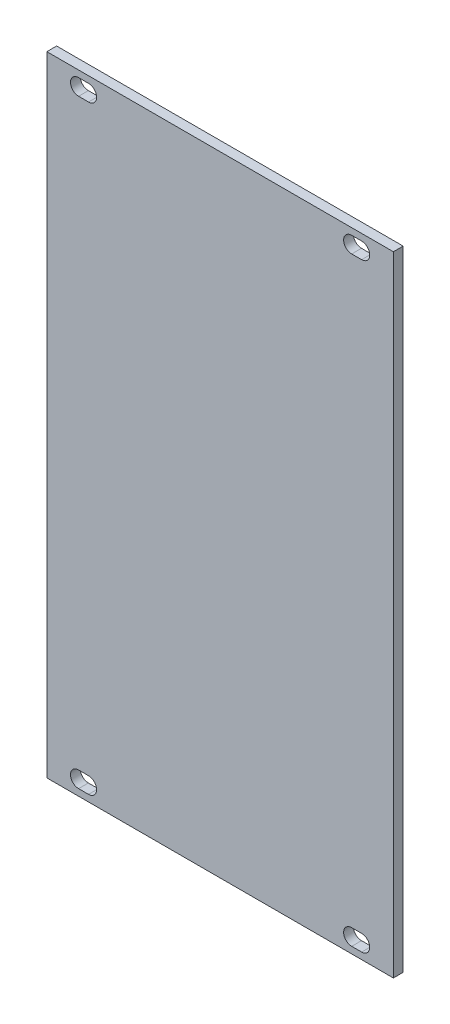
ISO-10303-21;
HEADER;
FILE_DESCRIPTION(('STEP AP214'),'2;1');
FILE_NAME('part.step','',(''),(''),'','','');
FILE_SCHEMA(('AUTOMOTIVE_DESIGN { 1 0 10303 214 1 1 1 1 }'));
ENDSEC;
DATA;
#1=APPLICATION_CONTEXT('core data for automotive mechanical design processes');
#2=APPLICATION_PROTOCOL_DEFINITION('international standard','automotive_design',2000,#1);
#3=PRODUCT_CONTEXT('',#1,'mechanical');
#4=PRODUCT('Part','Part','',(#3));
#5=PRODUCT_RELATED_PRODUCT_CATEGORY('part','',(#4));
#6=PRODUCT_DEFINITION_FORMATION('','',#4);
#7=PRODUCT_DEFINITION_CONTEXT('part definition',#1,'design');
#8=PRODUCT_DEFINITION('design','',#6,#7);
#9=PRODUCT_DEFINITION_SHAPE('','',#8);
#10=(LENGTH_UNIT() NAMED_UNIT(*) SI_UNIT(.MILLI.,.METRE.));
#11=(NAMED_UNIT(*) PLANE_ANGLE_UNIT() SI_UNIT($,.RADIAN.));
#12=(NAMED_UNIT(*) SI_UNIT($,.STERADIAN.) SOLID_ANGLE_UNIT());
#13=UNCERTAINTY_MEASURE_WITH_UNIT(LENGTH_MEASURE(1.E-05),#10,'distance_accuracy_value','');
#14=(GEOMETRIC_REPRESENTATION_CONTEXT(3) GLOBAL_UNCERTAINTY_ASSIGNED_CONTEXT((#13)) GLOBAL_UNIT_ASSIGNED_CONTEXT((#10,
#11,#12)) REPRESENTATION_CONTEXT('',''));
#15=CARTESIAN_POINT('',(0.,0.,0.));
#16=DIRECTION('',(0.,0.,1.));
#17=DIRECTION('',(1.,0.,0.));
#18=AXIS2_PLACEMENT_3D('',#15,#16,#17);
#19=CARTESIAN_POINT('',(0.,0.,2.));
#20=DIRECTION('',(0.,0.,1.));
#21=DIRECTION('',(1.,0.,0.));
#22=AXIS2_PLACEMENT_3D('',#19,#20,#21);
#23=PLANE('',#22);
#24=DIRECTION('',(0.,1.,0.));
#25=VECTOR('',#24,1.);
#26=CARTESIAN_POINT('',(35.4,64.25,2.));
#27=LINE('',#26,#25);
#28=CARTESIAN_POINT('',(35.4,-64.25,2.));
#29=VERTEX_POINT('',#28);
#30=CARTESIAN_POINT('',(35.4,64.25,2.));
#31=VERTEX_POINT('',#30);
#32=EDGE_CURVE('E360',#29,#31,#27,.T.);
#33=ORIENTED_EDGE('',*,*,#32,.T.);
#34=DIRECTION('',(-1.,0.,0.));
#35=VECTOR('',#34,1.);
#36=CARTESIAN_POINT('',(-35.4,64.25,2.));
#37=LINE('',#36,#35);
#38=CARTESIAN_POINT('',(-35.4,64.25,2.));
#39=VERTEX_POINT('',#38);
#40=EDGE_CURVE('E364',#31,#39,#37,.T.);
#41=ORIENTED_EDGE('',*,*,#40,.T.);
#42=DIRECTION('',(0.,-1.,0.));
#43=VECTOR('',#42,1.);
#44=CARTESIAN_POINT('',(-35.4,64.25,2.));
#45=LINE('',#44,#43);
#46=CARTESIAN_POINT('',(-35.4,-64.25,2.));
#47=VERTEX_POINT('',#46);
#48=EDGE_CURVE('E368',#39,#47,#45,.T.);
#49=ORIENTED_EDGE('',*,*,#48,.T.);
#50=DIRECTION('',(1.,0.,0.));
#51=VECTOR('',#50,1.);
#52=CARTESIAN_POINT('',(-35.4,-64.25,2.));
#53=LINE('',#52,#51);
#54=EDGE_CURVE('E371',#47,#29,#53,.T.);
#55=ORIENTED_EDGE('',*,*,#54,.T.);
#56=EDGE_LOOP('',(#33,#41,#49,#55));
#57=FACE_BOUND('',#56,.T.);
#58=DIRECTION('',(1.,0.,0.));
#59=VECTOR('',#58,1.);
#60=CARTESIAN_POINT('',(-28.916,-62.9,2.));
#61=LINE('',#60,#59);
#62=CARTESIAN_POINT('',(-28.916,-62.9,2.));
#63=VERTEX_POINT('',#62);
#64=CARTESIAN_POINT('',(-26.884,-62.9,2.));
#65=VERTEX_POINT('',#64);
#66=EDGE_CURVE('E320',#63,#65,#61,.T.);
#67=ORIENTED_EDGE('',*,*,#66,.F.);
#68=CARTESIAN_POINT('',(-28.916,-61.25,2.));
#69=DIRECTION('',(0.,0.,1.));
#70=DIRECTION('',(1.,0.,0.));
#71=AXIS2_PLACEMENT_3D('',#68,#69,#70);
#72=CIRCLE('',#71,1.65);
#73=CARTESIAN_POINT('',(-28.916,-59.6,2.));
#74=VERTEX_POINT('',#73);
#75=EDGE_CURVE('E317',#74,#63,#72,.T.);
#76=ORIENTED_EDGE('',*,*,#75,.F.);
#77=DIRECTION('',(-1.,0.,0.));
#78=VECTOR('',#77,1.);
#79=CARTESIAN_POINT('',(-28.916,-59.6,2.));
#80=LINE('',#79,#78);
#81=CARTESIAN_POINT('',(-26.884,-59.6,2.));
#82=VERTEX_POINT('',#81);
#83=EDGE_CURVE('E328',#82,#74,#80,.T.);
#84=ORIENTED_EDGE('',*,*,#83,.F.);
#85=CARTESIAN_POINT('',(-26.884,-61.25,2.));
#86=DIRECTION('',(0.,0.,1.));
#87=DIRECTION('',(1.,0.,0.));
#88=AXIS2_PLACEMENT_3D('',#85,#86,#87);
#89=CIRCLE('',#88,1.64999999999999);
#90=EDGE_CURVE('E324',#65,#82,#89,.T.);
#91=ORIENTED_EDGE('',*,*,#90,.F.);
#92=EDGE_LOOP('',(#67,#76,#84,#91));
#93=FACE_BOUND('',#92,.T.);
#94=DIRECTION('',(1.,0.,0.));
#95=VECTOR('',#94,1.);
#96=CARTESIAN_POINT('',(26.884000014,59.6,2.));
#97=LINE('',#96,#95);
#98=CARTESIAN_POINT('',(26.884000014,59.6,2.));
#99=VERTEX_POINT('',#98);
#100=CARTESIAN_POINT('',(28.916000014,59.6,2.));
#101=VERTEX_POINT('',#100);
#102=EDGE_CURVE('E277',#99,#101,#97,.T.);
#103=ORIENTED_EDGE('',*,*,#102,.F.);
#104=CARTESIAN_POINT('',(26.884000014,61.25,2.));
#105=DIRECTION('',(0.,0.,1.));
#106=DIRECTION('',(1.,0.,0.));
#107=AXIS2_PLACEMENT_3D('',#104,#105,#106);
#108=CIRCLE('',#107,1.65);
#109=CARTESIAN_POINT('',(26.884000014,62.9,2.));
#110=VERTEX_POINT('',#109);
#111=EDGE_CURVE('E274',#110,#99,#108,.T.);
#112=ORIENTED_EDGE('',*,*,#111,.F.);
#113=DIRECTION('',(-1.,0.,0.));
#114=VECTOR('',#113,1.);
#115=CARTESIAN_POINT('',(26.884000014,62.9,2.));
#116=LINE('',#115,#114);
#117=CARTESIAN_POINT('',(28.916000014,62.9,2.));
#118=VERTEX_POINT('',#117);
#119=EDGE_CURVE('E285',#118,#110,#116,.T.);
#120=ORIENTED_EDGE('',*,*,#119,.F.);
#121=CARTESIAN_POINT('',(28.916000014,61.25,2.));
#122=DIRECTION('',(0.,0.,1.));
#123=DIRECTION('',(1.,0.,0.));
#124=AXIS2_PLACEMENT_3D('',#121,#122,#123);
#125=CIRCLE('',#124,1.65);
#126=EDGE_CURVE('E281',#101,#118,#125,.T.);
#127=ORIENTED_EDGE('',*,*,#126,.F.);
#128=EDGE_LOOP('',(#103,#112,#120,#127));
#129=FACE_BOUND('',#128,.T.);
#130=DIRECTION('',(1.,0.,0.));
#131=VECTOR('',#130,1.);
#132=CARTESIAN_POINT('',(-28.916,59.6,2.));
#133=LINE('',#132,#131);
#134=CARTESIAN_POINT('',(-28.916,59.6,2.));
#135=VERTEX_POINT('',#134);
#136=CARTESIAN_POINT('',(-26.884,59.6,2.));
#137=VERTEX_POINT('',#136);
#138=EDGE_CURVE('E234',#135,#137,#133,.T.);
#139=ORIENTED_EDGE('',*,*,#138,.F.);
#140=CARTESIAN_POINT('',(-28.916,61.25,2.));
#141=DIRECTION('',(0.,0.,1.));
#142=DIRECTION('',(1.,0.,0.));
#143=AXIS2_PLACEMENT_3D('',#140,#141,#142);
#144=CIRCLE('',#143,1.64999999999998);
#145=CARTESIAN_POINT('',(-28.916,62.9,2.));
#146=VERTEX_POINT('',#145);
#147=EDGE_CURVE('E231',#146,#135,#144,.T.);
#148=ORIENTED_EDGE('',*,*,#147,.F.);
#149=DIRECTION('',(-1.,0.,0.));
#150=VECTOR('',#149,1.);
#151=CARTESIAN_POINT('',(-28.916,62.9,2.));
#152=LINE('',#151,#150);
#153=CARTESIAN_POINT('',(-26.884,62.9,2.));
#154=VERTEX_POINT('',#153);
#155=EDGE_CURVE('E242',#154,#146,#152,.T.);
#156=ORIENTED_EDGE('',*,*,#155,.F.);
#157=CARTESIAN_POINT('',(-26.884,61.25,2.));
#158=DIRECTION('',(0.,0.,1.));
#159=DIRECTION('',(1.,0.,0.));
#160=AXIS2_PLACEMENT_3D('',#157,#158,#159);
#161=CIRCLE('',#160,1.64999999999998);
#162=EDGE_CURVE('E238',#137,#154,#161,.T.);
#163=ORIENTED_EDGE('',*,*,#162,.F.);
#164=EDGE_LOOP('',(#139,#148,#156,#163));
#165=FACE_BOUND('',#164,.T.);
#166=DIRECTION('',(1.,0.,0.));
#167=VECTOR('',#166,1.);
#168=CARTESIAN_POINT('',(26.884000014,-62.9,2.));
#169=LINE('',#168,#167);
#170=CARTESIAN_POINT('',(26.884000014,-62.9,2.));
#171=VERTEX_POINT('',#170);
#172=CARTESIAN_POINT('',(28.916000014,-62.9,2.));
#173=VERTEX_POINT('',#172);
#174=EDGE_CURVE('E192',#171,#173,#169,.T.);
#175=ORIENTED_EDGE('',*,*,#174,.F.);
#176=CARTESIAN_POINT('',(26.884000014,-61.25,2.));
#177=DIRECTION('',(0.,0.,1.));
#178=DIRECTION('',(1.,0.,0.));
#179=AXIS2_PLACEMENT_3D('',#176,#177,#178);
#180=CIRCLE('',#179,1.65);
#181=CARTESIAN_POINT('',(26.884000014,-59.6,2.));
#182=VERTEX_POINT('',#181);
#183=EDGE_CURVE('E183',#182,#171,#180,.T.);
#184=ORIENTED_EDGE('',*,*,#183,.F.);
#185=DIRECTION('',(-1.,0.,0.));
#186=VECTOR('',#185,1.);
#187=CARTESIAN_POINT('',(26.884000014,-59.6,2.));
#188=LINE('',#187,#186);
#189=CARTESIAN_POINT('',(28.916000014,-59.6,2.));
#190=VERTEX_POINT('',#189);
#191=EDGE_CURVE('E209',#190,#182,#188,.T.);
#192=ORIENTED_EDGE('',*,*,#191,.F.);
#193=CARTESIAN_POINT('',(28.916000014,-61.25,2.));
#194=DIRECTION('',(0.,0.,1.));
#195=DIRECTION('',(1.,0.,0.));
#196=AXIS2_PLACEMENT_3D('',#193,#194,#195);
#197=CIRCLE('',#196,1.65);
#198=EDGE_CURVE('E205',#173,#190,#197,.T.);
#199=ORIENTED_EDGE('',*,*,#198,.F.);
#200=EDGE_LOOP('',(#175,#184,#192,#199));
#201=FACE_BOUND('',#200,.T.);
#202=ADVANCED_FACE('F45',(#57,#93,#129,#165,#201),#23,.T.);
#203=CARTESIAN_POINT('',(0.,0.,0.));
#204=DIRECTION('',(0.,0.,1.));
#205=DIRECTION('',(1.,0.,0.));
#206=AXIS2_PLACEMENT_3D('',#203,#204,#205);
#207=PLANE('',#206);
#208=CARTESIAN_POINT('',(-28.916,61.25,0.));
#209=DIRECTION('',(0.,0.,1.));
#210=DIRECTION('',(1.,0.,0.));
#211=AXIS2_PLACEMENT_3D('',#208,#209,#210);
#212=CIRCLE('',#211,1.64999999999998);
#213=CARTESIAN_POINT('',(-28.916,62.9,0.));
#214=VERTEX_POINT('',#213);
#215=CARTESIAN_POINT('',(-28.916,59.6,0.));
#216=VERTEX_POINT('',#215);
#217=EDGE_CURVE('E201',#214,#216,#212,.T.);
#218=ORIENTED_EDGE('',*,*,#217,.T.);
#219=DIRECTION('',(1.,0.,0.));
#220=VECTOR('',#219,1.);
#221=CARTESIAN_POINT('',(-28.916,59.6,0.));
#222=LINE('',#221,#220);
#223=CARTESIAN_POINT('',(-26.884,59.6,0.));
#224=VERTEX_POINT('',#223);
#225=EDGE_CURVE('E249',#216,#224,#222,.T.);
#226=ORIENTED_EDGE('',*,*,#225,.T.);
#227=CARTESIAN_POINT('',(-26.884,61.25,0.));
#228=DIRECTION('',(0.,0.,1.));
#229=DIRECTION('',(1.,0.,0.));
#230=AXIS2_PLACEMENT_3D('',#227,#228,#229);
#231=CIRCLE('',#230,1.64999999999998);
#232=CARTESIAN_POINT('',(-26.884,62.9,0.));
#233=VERTEX_POINT('',#232);
#234=EDGE_CURVE('E253',#224,#233,#231,.T.);
#235=ORIENTED_EDGE('',*,*,#234,.T.);
#236=DIRECTION('',(-1.,0.,0.));
#237=VECTOR('',#236,1.);
#238=CARTESIAN_POINT('',(-28.916,62.9,0.));
#239=LINE('',#238,#237);
#240=EDGE_CURVE('E235',#233,#214,#239,.T.);
#241=ORIENTED_EDGE('',*,*,#240,.T.);
#242=EDGE_LOOP('',(#218,#226,#235,#241));
#243=FACE_BOUND('',#242,.T.);
#244=CARTESIAN_POINT('',(-28.916,-61.25,0.));
#245=DIRECTION('',(0.,0.,1.));
#246=DIRECTION('',(1.,0.,0.));
#247=AXIS2_PLACEMENT_3D('',#244,#245,#246);
#248=CIRCLE('',#247,1.65);
#249=CARTESIAN_POINT('',(-28.916,-59.6,0.));
#250=VERTEX_POINT('',#249);
#251=CARTESIAN_POINT('',(-28.916,-62.9,0.));
#252=VERTEX_POINT('',#251);
#253=EDGE_CURVE('E316',#250,#252,#248,.T.);
#254=ORIENTED_EDGE('',*,*,#253,.T.);
#255=DIRECTION('',(1.,0.,0.));
#256=VECTOR('',#255,1.);
#257=CARTESIAN_POINT('',(-28.916,-62.9,0.));
#258=LINE('',#257,#256);
#259=CARTESIAN_POINT('',(-26.884,-62.9,0.));
#260=VERTEX_POINT('',#259);
#261=EDGE_CURVE('E335',#252,#260,#258,.T.);
#262=ORIENTED_EDGE('',*,*,#261,.T.);
#263=CARTESIAN_POINT('',(-26.884,-61.25,0.));
#264=DIRECTION('',(0.,0.,1.));
#265=DIRECTION('',(1.,0.,0.));
#266=AXIS2_PLACEMENT_3D('',#263,#264,#265);
#267=CIRCLE('',#266,1.64999999999999);
#268=CARTESIAN_POINT('',(-26.884,-59.6,0.));
#269=VERTEX_POINT('',#268);
#270=EDGE_CURVE('E339',#260,#269,#267,.T.);
#271=ORIENTED_EDGE('',*,*,#270,.T.);
#272=DIRECTION('',(-1.,0.,0.));
#273=VECTOR('',#272,1.);
#274=CARTESIAN_POINT('',(-28.916,-59.6,0.));
#275=LINE('',#274,#273);
#276=EDGE_CURVE('E321',#269,#250,#275,.T.);
#277=ORIENTED_EDGE('',*,*,#276,.T.);
#278=EDGE_LOOP('',(#254,#262,#271,#277));
#279=FACE_BOUND('',#278,.T.);
#280=DIRECTION('',(0.,1.,0.));
#281=VECTOR('',#280,1.);
#282=CARTESIAN_POINT('',(35.4,64.25,0.));
#283=LINE('',#282,#281);
#284=CARTESIAN_POINT('',(35.4,-64.25,0.));
#285=VERTEX_POINT('',#284);
#286=CARTESIAN_POINT('',(35.4,64.25,0.));
#287=VERTEX_POINT('',#286);
#288=EDGE_CURVE('E359',#285,#287,#283,.T.);
#289=ORIENTED_EDGE('',*,*,#288,.F.);
#290=DIRECTION('',(1.,0.,0.));
#291=VECTOR('',#290,1.);
#292=CARTESIAN_POINT('',(-35.4,-64.25,0.));
#293=LINE('',#292,#291);
#294=CARTESIAN_POINT('',(-35.4,-64.25,0.));
#295=VERTEX_POINT('',#294);
#296=EDGE_CURVE('E365',#295,#285,#293,.T.);
#297=ORIENTED_EDGE('',*,*,#296,.F.);
#298=DIRECTION('',(0.,-1.,0.));
#299=VECTOR('',#298,1.);
#300=CARTESIAN_POINT('',(-35.4,64.25,0.));
#301=LINE('',#300,#299);
#302=CARTESIAN_POINT('',(-35.4,64.25,0.));
#303=VERTEX_POINT('',#302);
#304=EDGE_CURVE('E381',#303,#295,#301,.T.);
#305=ORIENTED_EDGE('',*,*,#304,.F.);
#306=DIRECTION('',(-1.,0.,0.));
#307=VECTOR('',#306,1.);
#308=CARTESIAN_POINT('',(-35.4,64.25,0.));
#309=LINE('',#308,#307);
#310=EDGE_CURVE('E378',#287,#303,#309,.T.);
#311=ORIENTED_EDGE('',*,*,#310,.F.);
#312=EDGE_LOOP('',(#289,#297,#305,#311));
#313=FACE_BOUND('',#312,.T.);
#314=CARTESIAN_POINT('',(26.884000014,61.25,0.));
#315=DIRECTION('',(0.,0.,1.));
#316=DIRECTION('',(1.,0.,0.));
#317=AXIS2_PLACEMENT_3D('',#314,#315,#316);
#318=CIRCLE('',#317,1.65);
#319=CARTESIAN_POINT('',(26.884000014,62.9,0.));
#320=VERTEX_POINT('',#319);
#321=CARTESIAN_POINT('',(26.884000014,59.6,0.));
#322=VERTEX_POINT('',#321);
#323=EDGE_CURVE('E273',#320,#322,#318,.T.);
#324=ORIENTED_EDGE('',*,*,#323,.T.);
#325=DIRECTION('',(1.,0.,0.));
#326=VECTOR('',#325,1.);
#327=CARTESIAN_POINT('',(26.884000014,59.6,0.));
#328=LINE('',#327,#326);
#329=CARTESIAN_POINT('',(28.916000014,59.6,0.));
#330=VERTEX_POINT('',#329);
#331=EDGE_CURVE('E292',#322,#330,#328,.T.);
#332=ORIENTED_EDGE('',*,*,#331,.T.);
#333=CARTESIAN_POINT('',(28.916000014,61.25,0.));
#334=DIRECTION('',(0.,0.,1.));
#335=DIRECTION('',(1.,0.,0.));
#336=AXIS2_PLACEMENT_3D('',#333,#334,#335);
#337=CIRCLE('',#336,1.65);
#338=CARTESIAN_POINT('',(28.916000014,62.9,0.));
#339=VERTEX_POINT('',#338);
#340=EDGE_CURVE('E296',#330,#339,#337,.T.);
#341=ORIENTED_EDGE('',*,*,#340,.T.);
#342=DIRECTION('',(-1.,0.,0.));
#343=VECTOR('',#342,1.);
#344=CARTESIAN_POINT('',(26.884000014,62.9,0.));
#345=LINE('',#344,#343);
#346=EDGE_CURVE('E278',#339,#320,#345,.T.);
#347=ORIENTED_EDGE('',*,*,#346,.T.);
#348=EDGE_LOOP('',(#324,#332,#341,#347));
#349=FACE_BOUND('',#348,.T.);
#350=CARTESIAN_POINT('',(26.884000014,-61.25,0.));
#351=DIRECTION('',(0.,0.,1.));
#352=DIRECTION('',(1.,0.,0.));
#353=AXIS2_PLACEMENT_3D('',#350,#351,#352);
#354=CIRCLE('',#353,1.65);
#355=CARTESIAN_POINT('',(26.884000014,-59.6,0.));
#356=VERTEX_POINT('',#355);
#357=CARTESIAN_POINT('',(26.884000014,-62.9,0.));
#358=VERTEX_POINT('',#357);
#359=EDGE_CURVE('E69',#356,#358,#354,.T.);
#360=ORIENTED_EDGE('',*,*,#359,.T.);
#361=DIRECTION('',(1.,0.,0.));
#362=VECTOR('',#361,1.);
#363=CARTESIAN_POINT('',(26.884000014,-62.9,0.));
#364=LINE('',#363,#362);
#365=CARTESIAN_POINT('',(28.916000014,-62.9,0.));
#366=VERTEX_POINT('',#365);
#367=EDGE_CURVE('E199',#358,#366,#364,.T.);
#368=ORIENTED_EDGE('',*,*,#367,.T.);
#369=CARTESIAN_POINT('',(28.916000014,-61.25,0.));
#370=DIRECTION('',(0.,0.,1.));
#371=DIRECTION('',(1.,0.,0.));
#372=AXIS2_PLACEMENT_3D('',#369,#370,#371);
#373=CIRCLE('',#372,1.65);
#374=CARTESIAN_POINT('',(28.916000014,-59.6,0.));
#375=VERTEX_POINT('',#374);
#376=EDGE_CURVE('E218',#366,#375,#373,.T.);
#377=ORIENTED_EDGE('',*,*,#376,.T.);
#378=DIRECTION('',(-1.,0.,0.));
#379=VECTOR('',#378,1.);
#380=CARTESIAN_POINT('',(26.884000014,-59.6,0.));
#381=LINE('',#380,#379);
#382=EDGE_CURVE('E193',#375,#356,#381,.T.);
#383=ORIENTED_EDGE('',*,*,#382,.T.);
#384=EDGE_LOOP('',(#360,#368,#377,#383));
#385=FACE_BOUND('',#384,.T.);
#386=ADVANCED_FACE('F404',(#243,#279,#313,#349,#385),#207,.F.);
#387=CARTESIAN_POINT('',(35.4,64.25,2.));
#388=DIRECTION('',(-1.,0.,0.));
#389=DIRECTION('',(0.,-1.,0.));
#390=AXIS2_PLACEMENT_3D('',#387,#388,#389);
#391=PLANE('',#390);
#392=ORIENTED_EDGE('',*,*,#288,.T.);
#393=DIRECTION('',(0.,0.,-1.));
#394=VECTOR('',#393,1.);
#395=CARTESIAN_POINT('',(35.4,64.25,2.));
#396=LINE('',#395,#394);
#397=EDGE_CURVE('E11',#31,#287,#396,.T.);
#398=ORIENTED_EDGE('',*,*,#397,.F.);
#399=ORIENTED_EDGE('',*,*,#32,.F.);
#400=DIRECTION('',(0.,0.,-1.));
#401=VECTOR('',#400,1.);
#402=CARTESIAN_POINT('',(35.4,-64.25,2.));
#403=LINE('',#402,#401);
#404=EDGE_CURVE('E374',#29,#285,#403,.T.);
#405=ORIENTED_EDGE('',*,*,#404,.T.);
#406=EDGE_LOOP('',(#392,#398,#399,#405));
#407=FACE_BOUND('',#406,.T.);
#408=ADVANCED_FACE('F47',(#407),#391,.F.);
#409=CARTESIAN_POINT('',(-35.4,64.25,2.));
#410=DIRECTION('',(0.,-1.,0.));
#411=DIRECTION('',(0.,0.,-1.));
#412=AXIS2_PLACEMENT_3D('',#409,#410,#411);
#413=PLANE('',#412);
#414=ORIENTED_EDGE('',*,*,#310,.T.);
#415=DIRECTION('',(0.,0.,-1.));
#416=VECTOR('',#415,1.);
#417=CARTESIAN_POINT('',(-35.4,64.25,2.));
#418=LINE('',#417,#416);
#419=EDGE_CURVE('E54',#39,#303,#418,.T.);
#420=ORIENTED_EDGE('',*,*,#419,.F.);
#421=ORIENTED_EDGE('',*,*,#40,.F.);
#422=ORIENTED_EDGE('',*,*,#397,.T.);
#423=EDGE_LOOP('',(#414,#420,#421,#422));
#424=FACE_BOUND('',#423,.T.);
#425=ADVANCED_FACE('F415',(#424),#413,.F.);
#426=CARTESIAN_POINT('',(-35.4,64.25,2.));
#427=DIRECTION('',(1.,0.,0.));
#428=DIRECTION('',(0.,1.,0.));
#429=AXIS2_PLACEMENT_3D('',#426,#427,#428);
#430=PLANE('',#429);
#431=ORIENTED_EDGE('',*,*,#304,.T.);
#432=DIRECTION('',(0.,0.,-1.));
#433=VECTOR('',#432,1.);
#434=CARTESIAN_POINT('',(-35.4,-64.25,2.));
#435=LINE('',#434,#433);
#436=EDGE_CURVE('E389',#47,#295,#435,.T.);
#437=ORIENTED_EDGE('',*,*,#436,.F.);
#438=ORIENTED_EDGE('',*,*,#48,.F.);
#439=ORIENTED_EDGE('',*,*,#419,.T.);
#440=EDGE_LOOP('',(#431,#437,#438,#439));
#441=FACE_BOUND('',#440,.T.);
#442=ADVANCED_FACE('F398',(#441),#430,.F.);
#443=CARTESIAN_POINT('',(-35.4,-64.25,2.));
#444=DIRECTION('',(0.,1.,0.));
#445=DIRECTION('',(0.,0.,1.));
#446=AXIS2_PLACEMENT_3D('',#443,#444,#445);
#447=PLANE('',#446);
#448=ORIENTED_EDGE('',*,*,#296,.T.);
#449=ORIENTED_EDGE('',*,*,#404,.F.);
#450=ORIENTED_EDGE('',*,*,#54,.F.);
#451=ORIENTED_EDGE('',*,*,#436,.T.);
#452=EDGE_LOOP('',(#448,#449,#450,#451));
#453=FACE_BOUND('',#452,.T.);
#454=ADVANCED_FACE('F408',(#453),#447,.F.);
#455=CARTESIAN_POINT('',(-28.916,-61.25,2.));
#456=DIRECTION('',(0.,0.,-1.));
#457=DIRECTION('',(-1.,0.,0.));
#458=AXIS2_PLACEMENT_3D('',#455,#456,#457);
#459=CYLINDRICAL_SURFACE('',#458,1.65);
#460=ORIENTED_EDGE('',*,*,#253,.F.);
#461=DIRECTION('',(0.,0.,-1.));
#462=VECTOR('',#461,1.);
#463=CARTESIAN_POINT('',(-28.916,-59.6,2.));
#464=LINE('',#463,#462);
#465=EDGE_CURVE('E331',#74,#250,#464,.T.);
#466=ORIENTED_EDGE('',*,*,#465,.F.);
#467=ORIENTED_EDGE('',*,*,#75,.T.);
#468=DIRECTION('',(0.,0.,-1.));
#469=VECTOR('',#468,1.);
#470=CARTESIAN_POINT('',(-28.916,-62.9,2.));
#471=LINE('',#470,#469);
#472=EDGE_CURVE('E355',#63,#252,#471,.T.);
#473=ORIENTED_EDGE('',*,*,#472,.T.);
#474=EDGE_LOOP('',(#460,#466,#467,#473));
#475=FACE_BOUND('',#474,.T.);
#476=ADVANCED_FACE('F430',(#475),#459,.F.);
#477=CARTESIAN_POINT('',(-28.916,-62.9,2.));
#478=DIRECTION('',(0.,1.,0.));
#479=DIRECTION('',(-1.,0.,0.));
#480=AXIS2_PLACEMENT_3D('',#477,#478,#479);
#481=PLANE('',#480);
#482=ORIENTED_EDGE('',*,*,#261,.F.);
#483=ORIENTED_EDGE('',*,*,#472,.F.);
#484=ORIENTED_EDGE('',*,*,#66,.T.);
#485=DIRECTION('',(0.,0.,-1.));
#486=VECTOR('',#485,1.);
#487=CARTESIAN_POINT('',(-26.884,-62.9,2.));
#488=LINE('',#487,#486);
#489=EDGE_CURVE('E352',#65,#260,#488,.T.);
#490=ORIENTED_EDGE('',*,*,#489,.T.);
#491=EDGE_LOOP('',(#482,#483,#484,#490));
#492=FACE_BOUND('',#491,.T.);
#493=ADVANCED_FACE('F437',(#492),#481,.T.);
#494=CARTESIAN_POINT('',(-26.884,-61.25,2.));
#495=DIRECTION('',(0.,0.,-1.));
#496=DIRECTION('',(-1.,0.,0.));
#497=AXIS2_PLACEMENT_3D('',#494,#495,#496);
#498=CYLINDRICAL_SURFACE('',#497,1.64999999999999);
#499=ORIENTED_EDGE('',*,*,#270,.F.);
#500=ORIENTED_EDGE('',*,*,#489,.F.);
#501=ORIENTED_EDGE('',*,*,#90,.T.);
#502=DIRECTION('',(0.,0.,-1.));
#503=VECTOR('',#502,1.);
#504=CARTESIAN_POINT('',(-26.884,-59.6,2.));
#505=LINE('',#504,#503);
#506=EDGE_CURVE('E349',#82,#269,#505,.T.);
#507=ORIENTED_EDGE('',*,*,#506,.T.);
#508=EDGE_LOOP('',(#499,#500,#501,#507));
#509=FACE_BOUND('',#508,.T.);
#510=ADVANCED_FACE('F442',(#509),#498,.F.);
#511=CARTESIAN_POINT('',(-28.916,-59.6,2.));
#512=DIRECTION('',(0.,-1.,0.));
#513=DIRECTION('',(0.,0.,-1.));
#514=AXIS2_PLACEMENT_3D('',#511,#512,#513);
#515=PLANE('',#514);
#516=ORIENTED_EDGE('',*,*,#276,.F.);
#517=ORIENTED_EDGE('',*,*,#506,.F.);
#518=ORIENTED_EDGE('',*,*,#83,.T.);
#519=ORIENTED_EDGE('',*,*,#465,.T.);
#520=EDGE_LOOP('',(#516,#517,#518,#519));
#521=FACE_BOUND('',#520,.T.);
#522=ADVANCED_FACE('F450',(#521),#515,.T.);
#523=CARTESIAN_POINT('',(26.884000014,61.25,2.));
#524=DIRECTION('',(0.,0.,-1.));
#525=DIRECTION('',(-1.,0.,0.));
#526=AXIS2_PLACEMENT_3D('',#523,#524,#525);
#527=CYLINDRICAL_SURFACE('',#526,1.65);
#528=ORIENTED_EDGE('',*,*,#323,.F.);
#529=DIRECTION('',(0.,0.,-1.));
#530=VECTOR('',#529,1.);
#531=CARTESIAN_POINT('',(26.884000014,62.9,2.));
#532=LINE('',#531,#530);
#533=EDGE_CURVE('E288',#110,#320,#532,.T.);
#534=ORIENTED_EDGE('',*,*,#533,.F.);
#535=ORIENTED_EDGE('',*,*,#111,.T.);
#536=DIRECTION('',(0.,0.,-1.));
#537=VECTOR('',#536,1.);
#538=CARTESIAN_POINT('',(26.884000014,59.6,2.));
#539=LINE('',#538,#537);
#540=EDGE_CURVE('E312',#99,#322,#539,.T.);
#541=ORIENTED_EDGE('',*,*,#540,.T.);
#542=EDGE_LOOP('',(#528,#534,#535,#541));
#543=FACE_BOUND('',#542,.T.);
#544=ADVANCED_FACE('F504',(#543),#527,.F.);
#545=CARTESIAN_POINT('',(26.884000014,59.6,2.));
#546=DIRECTION('',(0.,1.,0.));
#547=DIRECTION('',(0.,0.,1.));
#548=AXIS2_PLACEMENT_3D('',#545,#546,#547);
#549=PLANE('',#548);
#550=ORIENTED_EDGE('',*,*,#331,.F.);
#551=ORIENTED_EDGE('',*,*,#540,.F.);
#552=ORIENTED_EDGE('',*,*,#102,.T.);
#553=DIRECTION('',(0.,0.,-1.));
#554=VECTOR('',#553,1.);
#555=CARTESIAN_POINT('',(28.916000014,59.6,2.));
#556=LINE('',#555,#554);
#557=EDGE_CURVE('E309',#101,#330,#556,.T.);
#558=ORIENTED_EDGE('',*,*,#557,.T.);
#559=EDGE_LOOP('',(#550,#551,#552,#558));
#560=FACE_BOUND('',#559,.T.);
#561=ADVANCED_FACE('F500',(#560),#549,.T.);
#562=CARTESIAN_POINT('',(28.916000014,61.25,2.));
#563=DIRECTION('',(0.,0.,-1.));
#564=DIRECTION('',(-1.,0.,0.));
#565=AXIS2_PLACEMENT_3D('',#562,#563,#564);
#566=CYLINDRICAL_SURFACE('',#565,1.65);
#567=ORIENTED_EDGE('',*,*,#340,.F.);
#568=ORIENTED_EDGE('',*,*,#557,.F.);
#569=ORIENTED_EDGE('',*,*,#126,.T.);
#570=DIRECTION('',(0.,0.,-1.));
#571=VECTOR('',#570,1.);
#572=CARTESIAN_POINT('',(28.916000014,62.9,2.));
#573=LINE('',#572,#571);
#574=EDGE_CURVE('E306',#118,#339,#573,.T.);
#575=ORIENTED_EDGE('',*,*,#574,.T.);
#576=EDGE_LOOP('',(#567,#568,#569,#575));
#577=FACE_BOUND('',#576,.T.);
#578=ADVANCED_FACE('F496',(#577),#566,.F.);
#579=CARTESIAN_POINT('',(26.884000014,62.9,2.));
#580=DIRECTION('',(0.,-1.,0.));
#581=DIRECTION('',(0.,0.,-1.));
#582=AXIS2_PLACEMENT_3D('',#579,#580,#581);
#583=PLANE('',#582);
#584=ORIENTED_EDGE('',*,*,#346,.F.);
#585=ORIENTED_EDGE('',*,*,#574,.F.);
#586=ORIENTED_EDGE('',*,*,#119,.T.);
#587=ORIENTED_EDGE('',*,*,#533,.T.);
#588=EDGE_LOOP('',(#584,#585,#586,#587));
#589=FACE_BOUND('',#588,.T.);
#590=ADVANCED_FACE('F493',(#589),#583,.T.);
#591=CARTESIAN_POINT('',(-28.916,61.25,2.));
#592=DIRECTION('',(0.,0.,-1.));
#593=DIRECTION('',(-1.,0.,0.));
#594=AXIS2_PLACEMENT_3D('',#591,#592,#593);
#595=CYLINDRICAL_SURFACE('',#594,1.64999999999998);
#596=ORIENTED_EDGE('',*,*,#217,.F.);
#597=DIRECTION('',(0.,0.,-1.));
#598=VECTOR('',#597,1.);
#599=CARTESIAN_POINT('',(-28.916,62.9,2.));
#600=LINE('',#599,#598);
#601=EDGE_CURVE('E245',#146,#214,#600,.T.);
#602=ORIENTED_EDGE('',*,*,#601,.F.);
#603=ORIENTED_EDGE('',*,*,#147,.T.);
#604=DIRECTION('',(0.,0.,-1.));
#605=VECTOR('',#604,1.);
#606=CARTESIAN_POINT('',(-28.916,59.6,2.));
#607=LINE('',#606,#605);
#608=EDGE_CURVE('E269',#135,#216,#607,.T.);
#609=ORIENTED_EDGE('',*,*,#608,.T.);
#610=EDGE_LOOP('',(#596,#602,#603,#609));
#611=FACE_BOUND('',#610,.T.);
#612=ADVANCED_FACE('F475',(#611),#595,.F.);
#613=CARTESIAN_POINT('',(-28.916,59.6,2.));
#614=DIRECTION('',(0.,1.,0.));
#615=DIRECTION('',(0.,0.,1.));
#616=AXIS2_PLACEMENT_3D('',#613,#614,#615);
#617=PLANE('',#616);
#618=ORIENTED_EDGE('',*,*,#225,.F.);
#619=ORIENTED_EDGE('',*,*,#608,.F.);
#620=ORIENTED_EDGE('',*,*,#138,.T.);
#621=DIRECTION('',(0.,0.,-1.));
#622=VECTOR('',#621,1.);
#623=CARTESIAN_POINT('',(-26.884,59.6,2.));
#624=LINE('',#623,#622);
#625=EDGE_CURVE('E266',#137,#224,#624,.T.);
#626=ORIENTED_EDGE('',*,*,#625,.T.);
#627=EDGE_LOOP('',(#618,#619,#620,#626));
#628=FACE_BOUND('',#627,.T.);
#629=ADVANCED_FACE('F469',(#628),#617,.T.);
#630=CARTESIAN_POINT('',(-26.884,61.25,2.));
#631=DIRECTION('',(0.,0.,-1.));
#632=DIRECTION('',(-1.,0.,0.));
#633=AXIS2_PLACEMENT_3D('',#630,#631,#632);
#634=CYLINDRICAL_SURFACE('',#633,1.64999999999998);
#635=ORIENTED_EDGE('',*,*,#234,.F.);
#636=ORIENTED_EDGE('',*,*,#625,.F.);
#637=ORIENTED_EDGE('',*,*,#162,.T.);
#638=DIRECTION('',(0.,0.,-1.));
#639=VECTOR('',#638,1.);
#640=CARTESIAN_POINT('',(-26.884,62.9,2.));
#641=LINE('',#640,#639);
#642=EDGE_CURVE('E263',#154,#233,#641,.T.);
#643=ORIENTED_EDGE('',*,*,#642,.T.);
#644=EDGE_LOOP('',(#635,#636,#637,#643));
#645=FACE_BOUND('',#644,.T.);
#646=ADVANCED_FACE('F472',(#645),#634,.F.);
#647=CARTESIAN_POINT('',(-28.916,62.9,2.));
#648=DIRECTION('',(0.,-1.,0.));
#649=DIRECTION('',(0.,0.,-1.));
#650=AXIS2_PLACEMENT_3D('',#647,#648,#649);
#651=PLANE('',#650);
#652=ORIENTED_EDGE('',*,*,#240,.F.);
#653=ORIENTED_EDGE('',*,*,#642,.F.);
#654=ORIENTED_EDGE('',*,*,#155,.T.);
#655=ORIENTED_EDGE('',*,*,#601,.T.);
#656=EDGE_LOOP('',(#652,#653,#654,#655));
#657=FACE_BOUND('',#656,.T.);
#658=ADVANCED_FACE('F478',(#657),#651,.T.);
#659=CARTESIAN_POINT('',(26.884000014,-61.25,2.));
#660=DIRECTION('',(0.,0.,-1.));
#661=DIRECTION('',(-1.,0.,0.));
#662=AXIS2_PLACEMENT_3D('',#659,#660,#661);
#663=CYLINDRICAL_SURFACE('',#662,1.65);
#664=ORIENTED_EDGE('',*,*,#359,.F.);
#665=DIRECTION('',(0.,0.,-1.));
#666=VECTOR('',#665,1.);
#667=CARTESIAN_POINT('',(26.884000014,-59.6,2.));
#668=LINE('',#667,#666);
#669=EDGE_CURVE('E187',#182,#356,#668,.T.);
#670=ORIENTED_EDGE('',*,*,#669,.F.);
#671=ORIENTED_EDGE('',*,*,#183,.T.);
#672=DIRECTION('',(0.,0.,-1.));
#673=VECTOR('',#672,1.);
#674=CARTESIAN_POINT('',(26.884000014,-62.9,2.));
#675=LINE('',#674,#673);
#676=EDGE_CURVE('E186',#171,#358,#675,.T.);
#677=ORIENTED_EDGE('',*,*,#676,.T.);
#678=EDGE_LOOP('',(#664,#670,#671,#677));
#679=FACE_BOUND('',#678,.T.);
#680=ADVANCED_FACE('F185',(#679),#663,.F.);
#681=CARTESIAN_POINT('',(26.884000014,-62.9,2.));
#682=DIRECTION('',(0.,1.,0.));
#683=DIRECTION('',(0.,0.,1.));
#684=AXIS2_PLACEMENT_3D('',#681,#682,#683);
#685=PLANE('',#684);
#686=ORIENTED_EDGE('',*,*,#367,.F.);
#687=ORIENTED_EDGE('',*,*,#676,.F.);
#688=ORIENTED_EDGE('',*,*,#174,.T.);
#689=DIRECTION('',(0.,0.,-1.));
#690=VECTOR('',#689,1.);
#691=CARTESIAN_POINT('',(28.916000014,-62.9,2.));
#692=LINE('',#691,#690);
#693=EDGE_CURVE('E202',#173,#366,#692,.T.);
#694=ORIENTED_EDGE('',*,*,#693,.T.);
#695=EDGE_LOOP('',(#686,#687,#688,#694));
#696=FACE_BOUND('',#695,.T.);
#697=ADVANCED_FACE('F196',(#696),#685,.T.);
#698=CARTESIAN_POINT('',(28.916000014,-61.25,2.));
#699=DIRECTION('',(0.,0.,-1.));
#700=DIRECTION('',(-1.,0.,0.));
#701=AXIS2_PLACEMENT_3D('',#698,#699,#700);
#702=CYLINDRICAL_SURFACE('',#701,1.65);
#703=ORIENTED_EDGE('',*,*,#376,.F.);
#704=ORIENTED_EDGE('',*,*,#693,.F.);
#705=ORIENTED_EDGE('',*,*,#198,.T.);
#706=DIRECTION('',(0.,0.,-1.));
#707=VECTOR('',#706,1.);
#708=CARTESIAN_POINT('',(28.916000014,-59.6,2.));
#709=LINE('',#708,#707);
#710=EDGE_CURVE('E61',#190,#375,#709,.T.);
#711=ORIENTED_EDGE('',*,*,#710,.T.);
#712=EDGE_LOOP('',(#703,#704,#705,#711));
#713=FACE_BOUND('',#712,.T.);
#714=ADVANCED_FACE('F576',(#713),#702,.F.);
#715=CARTESIAN_POINT('',(26.884000014,-59.6,2.));
#716=DIRECTION('',(0.,-1.,0.));
#717=DIRECTION('',(0.,0.,-1.));
#718=AXIS2_PLACEMENT_3D('',#715,#716,#717);
#719=PLANE('',#718);
#720=ORIENTED_EDGE('',*,*,#382,.F.);
#721=ORIENTED_EDGE('',*,*,#710,.F.);
#722=ORIENTED_EDGE('',*,*,#191,.T.);
#723=ORIENTED_EDGE('',*,*,#669,.T.);
#724=EDGE_LOOP('',(#720,#721,#722,#723));
#725=FACE_BOUND('',#724,.T.);
#726=ADVANCED_FACE('F584',(#725),#719,.T.);
#727=CLOSED_SHELL('',(#202,#386,#408,#425,#442,#454,#476,#493,#510,#522,#544,#561,#578,#590,
#612,#629,#646,#658,#680,#697,#714,#726));
#728=MANIFOLD_SOLID_BREP('B2',#727);
#729=ADVANCED_BREP_SHAPE_REPRESENTATION('',(#18,#728),#14);
#730=SHAPE_DEFINITION_REPRESENTATION(#9,#729);
ENDSEC;
END-ISO-10303-21;
